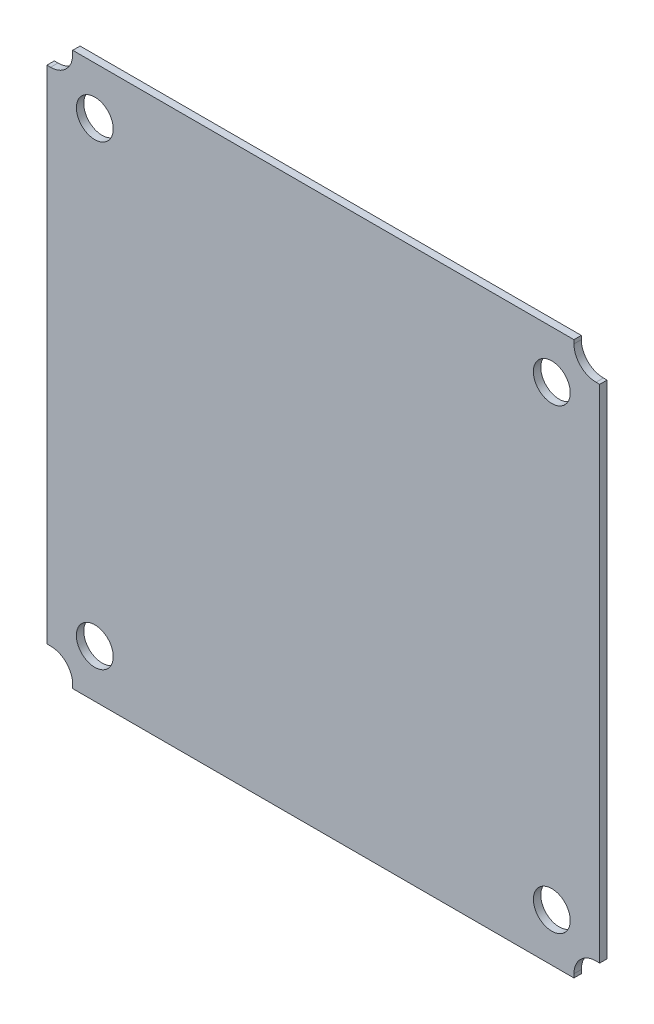
ISO-10303-21;
HEADER;
FILE_DESCRIPTION(('STEP AP214'),'2;1');
FILE_NAME('part.step','',(''),(''),'','','');
FILE_SCHEMA(('AUTOMOTIVE_DESIGN { 1 0 10303 214 1 1 1 1 }'));
ENDSEC;
DATA;
#1=APPLICATION_CONTEXT('core data for automotive mechanical design processes');
#2=APPLICATION_PROTOCOL_DEFINITION('international standard','automotive_design',2000,#1);
#3=PRODUCT_CONTEXT('',#1,'mechanical');
#4=PRODUCT('Part','Part','',(#3));
#5=PRODUCT_RELATED_PRODUCT_CATEGORY('part','',(#4));
#6=PRODUCT_DEFINITION_FORMATION('','',#4);
#7=PRODUCT_DEFINITION_CONTEXT('part definition',#1,'design');
#8=PRODUCT_DEFINITION('design','',#6,#7);
#9=PRODUCT_DEFINITION_SHAPE('','',#8);
#10=(LENGTH_UNIT() NAMED_UNIT(*) SI_UNIT(.MILLI.,.METRE.));
#11=(NAMED_UNIT(*) PLANE_ANGLE_UNIT() SI_UNIT($,.RADIAN.));
#12=(NAMED_UNIT(*) SI_UNIT($,.STERADIAN.) SOLID_ANGLE_UNIT());
#13=UNCERTAINTY_MEASURE_WITH_UNIT(LENGTH_MEASURE(1.E-05),#10,'distance_accuracy_value','');
#14=(GEOMETRIC_REPRESENTATION_CONTEXT(3) GLOBAL_UNCERTAINTY_ASSIGNED_CONTEXT((#13)) GLOBAL_UNIT_ASSIGNED_CONTEXT((#10,
#11,#12)) REPRESENTATION_CONTEXT('',''));
#15=CARTESIAN_POINT('',(0.,0.,0.));
#16=DIRECTION('',(0.,0.,1.));
#17=DIRECTION('',(1.,0.,0.));
#18=AXIS2_PLACEMENT_3D('',#15,#16,#17);
#19=CARTESIAN_POINT('',(0.,0.,1.));
#20=DIRECTION('',(0.,0.,1.));
#21=DIRECTION('',(1.,0.,0.));
#22=AXIS2_PLACEMENT_3D('',#19,#20,#21);
#23=PLANE('',#22);
#24=DIRECTION('',(1.,0.,0.));
#25=VECTOR('',#24,1.);
#26=CARTESIAN_POINT('',(0.,37.5,1.));
#27=LINE('',#26,#25);
#28=CARTESIAN_POINT('',(-34.,37.5,1.));
#29=VERTEX_POINT('',#28);
#30=CARTESIAN_POINT('',(34.,37.5,1.));
#31=VERTEX_POINT('',#30);
#32=EDGE_CURVE('E149',#29,#31,#27,.T.);
#33=ORIENTED_EDGE('',*,*,#32,.F.);
#34=DIRECTION('',(0.,-1.,0.));
#35=VECTOR('',#34,1.);
#36=CARTESIAN_POINT('',(-34.,0.,1.));
#37=LINE('',#36,#35);
#38=CARTESIAN_POINT('',(-34.,37.,1.));
#39=VERTEX_POINT('',#38);
#40=EDGE_CURVE('E228',#29,#39,#37,.T.);
#41=ORIENTED_EDGE('',*,*,#40,.T.);
#42=CARTESIAN_POINT('',(-37.,37.,1.));
#43=DIRECTION('',(0.,0.,1.));
#44=DIRECTION('',(1.,0.,0.));
#45=AXIS2_PLACEMENT_3D('',#42,#43,#44);
#46=CIRCLE('',#45,3.);
#47=CARTESIAN_POINT('',(-37.,34.,1.));
#48=VERTEX_POINT('',#47);
#49=EDGE_CURVE('E11',#39,#48,#46,.F.);
#50=ORIENTED_EDGE('',*,*,#49,.T.);
#51=DIRECTION('',(1.,0.,0.));
#52=VECTOR('',#51,1.);
#53=CARTESIAN_POINT('',(0.,34.,1.));
#54=LINE('',#53,#52);
#55=CARTESIAN_POINT('',(-37.5,34.,1.));
#56=VERTEX_POINT('',#55);
#57=EDGE_CURVE('E283',#56,#48,#54,.T.);
#58=ORIENTED_EDGE('',*,*,#57,.F.);
#59=DIRECTION('',(0.,-1.,0.));
#60=VECTOR('',#59,1.);
#61=CARTESIAN_POINT('',(-37.5,0.,1.));
#62=LINE('',#61,#60);
#63=CARTESIAN_POINT('',(-37.5,-34.,1.));
#64=VERTEX_POINT('',#63);
#65=EDGE_CURVE('E153',#56,#64,#62,.T.);
#66=ORIENTED_EDGE('',*,*,#65,.T.);
#67=DIRECTION('',(1.,0.,0.));
#68=VECTOR('',#67,1.);
#69=CARTESIAN_POINT('',(0.,-34.,1.));
#70=LINE('',#69,#68);
#71=CARTESIAN_POINT('',(-37.,-34.,1.));
#72=VERTEX_POINT('',#71);
#73=EDGE_CURVE('E285',#64,#72,#70,.T.);
#74=ORIENTED_EDGE('',*,*,#73,.T.);
#75=CARTESIAN_POINT('',(-37.,-37.,1.));
#76=DIRECTION('',(0.,0.,1.));
#77=DIRECTION('',(1.,0.,0.));
#78=AXIS2_PLACEMENT_3D('',#75,#76,#77);
#79=CIRCLE('',#78,3.);
#80=CARTESIAN_POINT('',(-34.,-37.,1.));
#81=VERTEX_POINT('',#80);
#82=EDGE_CURVE('E212',#72,#81,#79,.F.);
#83=ORIENTED_EDGE('',*,*,#82,.T.);
#84=DIRECTION('',(0.,-1.,0.));
#85=VECTOR('',#84,1.);
#86=CARTESIAN_POINT('',(-34.,0.,1.));
#87=LINE('',#86,#85);
#88=CARTESIAN_POINT('',(-34.,-37.5,1.));
#89=VERTEX_POINT('',#88);
#90=EDGE_CURVE('E188',#81,#89,#87,.T.);
#91=ORIENTED_EDGE('',*,*,#90,.T.);
#92=DIRECTION('',(1.,0.,0.));
#93=VECTOR('',#92,1.);
#94=CARTESIAN_POINT('',(0.,-37.5,1.));
#95=LINE('',#94,#93);
#96=CARTESIAN_POINT('',(34.,-37.5,1.));
#97=VERTEX_POINT('',#96);
#98=EDGE_CURVE('E244',#89,#97,#95,.T.);
#99=ORIENTED_EDGE('',*,*,#98,.T.);
#100=DIRECTION('',(0.,-1.,0.));
#101=VECTOR('',#100,1.);
#102=CARTESIAN_POINT('',(34.,0.,1.));
#103=LINE('',#102,#101);
#104=CARTESIAN_POINT('',(34.,-37.,1.));
#105=VERTEX_POINT('',#104);
#106=EDGE_CURVE('E271',#105,#97,#103,.T.);
#107=ORIENTED_EDGE('',*,*,#106,.F.);
#108=CARTESIAN_POINT('',(37.,-37.,1.));
#109=DIRECTION('',(0.,0.,1.));
#110=DIRECTION('',(1.,0.,0.));
#111=AXIS2_PLACEMENT_3D('',#108,#109,#110);
#112=CIRCLE('',#111,3.);
#113=CARTESIAN_POINT('',(37.,-34.,1.));
#114=VERTEX_POINT('',#113);
#115=EDGE_CURVE('E207',#105,#114,#112,.F.);
#116=ORIENTED_EDGE('',*,*,#115,.T.);
#117=DIRECTION('',(1.,0.,0.));
#118=VECTOR('',#117,1.);
#119=CARTESIAN_POINT('',(0.,-34.,1.));
#120=LINE('',#119,#118);
#121=CARTESIAN_POINT('',(37.5,-34.,1.));
#122=VERTEX_POINT('',#121);
#123=EDGE_CURVE('E274',#114,#122,#120,.T.);
#124=ORIENTED_EDGE('',*,*,#123,.T.);
#125=DIRECTION('',(0.,-1.,0.));
#126=VECTOR('',#125,1.);
#127=CARTESIAN_POINT('',(37.5,0.,1.));
#128=LINE('',#127,#126);
#129=CARTESIAN_POINT('',(37.5,34.,1.));
#130=VERTEX_POINT('',#129);
#131=EDGE_CURVE('E234',#130,#122,#128,.T.);
#132=ORIENTED_EDGE('',*,*,#131,.F.);
#133=DIRECTION('',(1.,0.,0.));
#134=VECTOR('',#133,1.);
#135=CARTESIAN_POINT('',(0.,34.,1.));
#136=LINE('',#135,#134);
#137=CARTESIAN_POINT('',(37.,34.,1.));
#138=VERTEX_POINT('',#137);
#139=EDGE_CURVE('E277',#138,#130,#136,.T.);
#140=ORIENTED_EDGE('',*,*,#139,.F.);
#141=CARTESIAN_POINT('',(37.,37.,1.));
#142=DIRECTION('',(0.,0.,1.));
#143=DIRECTION('',(1.,0.,0.));
#144=AXIS2_PLACEMENT_3D('',#141,#142,#143);
#145=CIRCLE('',#144,3.);
#146=CARTESIAN_POINT('',(34.,37.,1.));
#147=VERTEX_POINT('',#146);
#148=EDGE_CURVE('E216',#138,#147,#145,.F.);
#149=ORIENTED_EDGE('',*,*,#148,.T.);
#150=DIRECTION('',(0.,-1.,0.));
#151=VECTOR('',#150,1.);
#152=CARTESIAN_POINT('',(34.,0.,1.));
#153=LINE('',#152,#151);
#154=EDGE_CURVE('E280',#31,#147,#153,.T.);
#155=ORIENTED_EDGE('',*,*,#154,.F.);
#156=EDGE_LOOP('',(#33,#41,#50,#58,#66,#74,#83,#91,#99,#107,#116,#124,#132,#140,#149,#155));
#157=FACE_BOUND('',#156,.T.);
#158=CARTESIAN_POINT('',(-31.,-31.,1.));
#159=DIRECTION('',(0.,0.,1.));
#160=DIRECTION('',(1.,0.,0.));
#161=AXIS2_PLACEMENT_3D('',#158,#159,#160);
#162=CIRCLE('',#161,2.5);
#163=CARTESIAN_POINT('',(-28.5,-31.,1.));
#164=VERTEX_POINT('',#163);
#165=EDGE_CURVE('E183',#164,#164,#162,.T.);
#166=ORIENTED_EDGE('',*,*,#165,.F.);
#167=EDGE_LOOP('',(#166));
#168=FACE_BOUND('',#167,.T.);
#169=CARTESIAN_POINT('',(31.,-31.,1.));
#170=DIRECTION('',(0.,0.,1.));
#171=DIRECTION('',(1.,0.,0.));
#172=AXIS2_PLACEMENT_3D('',#169,#170,#171);
#173=CIRCLE('',#172,2.5);
#174=CARTESIAN_POINT('',(33.5,-31.,1.));
#175=VERTEX_POINT('',#174);
#176=EDGE_CURVE('E262',#175,#175,#173,.T.);
#177=ORIENTED_EDGE('',*,*,#176,.F.);
#178=EDGE_LOOP('',(#177));
#179=FACE_BOUND('',#178,.T.);
#180=CARTESIAN_POINT('',(31.,31.,1.));
#181=DIRECTION('',(0.,0.,1.));
#182=DIRECTION('',(1.,0.,0.));
#183=AXIS2_PLACEMENT_3D('',#180,#181,#182);
#184=CIRCLE('',#183,2.5);
#185=CARTESIAN_POINT('',(33.5,31.,1.));
#186=VERTEX_POINT('',#185);
#187=EDGE_CURVE('E265',#186,#186,#184,.T.);
#188=ORIENTED_EDGE('',*,*,#187,.F.);
#189=EDGE_LOOP('',(#188));
#190=FACE_BOUND('',#189,.T.);
#191=CARTESIAN_POINT('',(-31.,31.,1.));
#192=DIRECTION('',(0.,0.,1.));
#193=DIRECTION('',(1.,0.,0.));
#194=AXIS2_PLACEMENT_3D('',#191,#192,#193);
#195=CIRCLE('',#194,2.5);
#196=CARTESIAN_POINT('',(-28.5,31.,1.));
#197=VERTEX_POINT('',#196);
#198=EDGE_CURVE('E268',#197,#197,#195,.T.);
#199=ORIENTED_EDGE('',*,*,#198,.F.);
#200=EDGE_LOOP('',(#199));
#201=FACE_BOUND('',#200,.T.);
#202=ADVANCED_FACE('F35',(#157,#168,#179,#190,#201),#23,.T.);
#203=CARTESIAN_POINT('',(0.,0.,0.));
#204=DIRECTION('',(0.,0.,1.));
#205=DIRECTION('',(1.,0.,0.));
#206=AXIS2_PLACEMENT_3D('',#203,#204,#205);
#207=PLANE('',#206);
#208=CARTESIAN_POINT('',(-31.,-31.,0.));
#209=DIRECTION('',(0.,0.,1.));
#210=DIRECTION('',(1.,0.,0.));
#211=AXIS2_PLACEMENT_3D('',#208,#209,#210);
#212=CIRCLE('',#211,2.5);
#213=CARTESIAN_POINT('',(-28.5,-31.,0.));
#214=VERTEX_POINT('',#213);
#215=EDGE_CURVE('E257',#214,#214,#212,.T.);
#216=ORIENTED_EDGE('',*,*,#215,.T.);
#217=EDGE_LOOP('',(#216));
#218=FACE_BOUND('',#217,.T.);
#219=CARTESIAN_POINT('',(31.,-31.,0.));
#220=DIRECTION('',(0.,0.,1.));
#221=DIRECTION('',(1.,0.,0.));
#222=AXIS2_PLACEMENT_3D('',#219,#220,#221);
#223=CIRCLE('',#222,2.5);
#224=CARTESIAN_POINT('',(33.5,-31.,0.));
#225=VERTEX_POINT('',#224);
#226=EDGE_CURVE('E291',#225,#225,#223,.T.);
#227=ORIENTED_EDGE('',*,*,#226,.T.);
#228=EDGE_LOOP('',(#227));
#229=FACE_BOUND('',#228,.T.);
#230=CARTESIAN_POINT('',(31.,31.,0.));
#231=DIRECTION('',(0.,0.,1.));
#232=DIRECTION('',(1.,0.,0.));
#233=AXIS2_PLACEMENT_3D('',#230,#231,#232);
#234=CIRCLE('',#233,2.5);
#235=CARTESIAN_POINT('',(33.5,31.,0.));
#236=VERTEX_POINT('',#235);
#237=EDGE_CURVE('E294',#236,#236,#234,.T.);
#238=ORIENTED_EDGE('',*,*,#237,.T.);
#239=EDGE_LOOP('',(#238));
#240=FACE_BOUND('',#239,.T.);
#241=CARTESIAN_POINT('',(-31.,31.,0.));
#242=DIRECTION('',(0.,0.,1.));
#243=DIRECTION('',(1.,0.,0.));
#244=AXIS2_PLACEMENT_3D('',#241,#242,#243);
#245=CIRCLE('',#244,2.5);
#246=CARTESIAN_POINT('',(-28.5,31.,0.));
#247=VERTEX_POINT('',#246);
#248=EDGE_CURVE('E297',#247,#247,#245,.T.);
#249=ORIENTED_EDGE('',*,*,#248,.T.);
#250=EDGE_LOOP('',(#249));
#251=FACE_BOUND('',#250,.T.);
#252=DIRECTION('',(0.,-1.,0.));
#253=VECTOR('',#252,1.);
#254=CARTESIAN_POINT('',(-34.,0.,0.));
#255=LINE('',#254,#253);
#256=CARTESIAN_POINT('',(-34.,37.5,0.));
#257=VERTEX_POINT('',#256);
#258=CARTESIAN_POINT('',(-34.,37.,0.));
#259=VERTEX_POINT('',#258);
#260=EDGE_CURVE('E162',#257,#259,#255,.T.);
#261=ORIENTED_EDGE('',*,*,#260,.F.);
#262=DIRECTION('',(1.,0.,0.));
#263=VECTOR('',#262,1.);
#264=CARTESIAN_POINT('',(0.,37.5,0.));
#265=LINE('',#264,#263);
#266=CARTESIAN_POINT('',(34.,37.5,0.));
#267=VERTEX_POINT('',#266);
#268=EDGE_CURVE('E58',#257,#267,#265,.T.);
#269=ORIENTED_EDGE('',*,*,#268,.T.);
#270=DIRECTION('',(0.,-1.,0.));
#271=VECTOR('',#270,1.);
#272=CARTESIAN_POINT('',(34.,0.,0.));
#273=LINE('',#272,#271);
#274=CARTESIAN_POINT('',(34.,37.,0.));
#275=VERTEX_POINT('',#274);
#276=EDGE_CURVE('E159',#267,#275,#273,.T.);
#277=ORIENTED_EDGE('',*,*,#276,.T.);
#278=CARTESIAN_POINT('',(37.,37.,0.));
#279=DIRECTION('',(0.,0.,1.));
#280=DIRECTION('',(1.,0.,0.));
#281=AXIS2_PLACEMENT_3D('',#278,#279,#280);
#282=CIRCLE('',#281,3.);
#283=CARTESIAN_POINT('',(37.,34.,0.));
#284=VERTEX_POINT('',#283);
#285=EDGE_CURVE('E214',#275,#284,#282,.T.);
#286=ORIENTED_EDGE('',*,*,#285,.T.);
#287=DIRECTION('',(1.,0.,0.));
#288=VECTOR('',#287,1.);
#289=CARTESIAN_POINT('',(0.,34.,0.));
#290=LINE('',#289,#288);
#291=CARTESIAN_POINT('',(37.5,34.,0.));
#292=VERTEX_POINT('',#291);
#293=EDGE_CURVE('E168',#284,#292,#290,.T.);
#294=ORIENTED_EDGE('',*,*,#293,.T.);
#295=DIRECTION('',(0.,-1.,0.));
#296=VECTOR('',#295,1.);
#297=CARTESIAN_POINT('',(37.5,0.,0.));
#298=LINE('',#297,#296);
#299=CARTESIAN_POINT('',(37.5,-34.,0.));
#300=VERTEX_POINT('',#299);
#301=EDGE_CURVE('E50',#292,#300,#298,.T.);
#302=ORIENTED_EDGE('',*,*,#301,.T.);
#303=DIRECTION('',(1.,0.,0.));
#304=VECTOR('',#303,1.);
#305=CARTESIAN_POINT('',(0.,-34.,0.));
#306=LINE('',#305,#304);
#307=CARTESIAN_POINT('',(37.,-34.,0.));
#308=VERTEX_POINT('',#307);
#309=EDGE_CURVE('E173',#308,#300,#306,.T.);
#310=ORIENTED_EDGE('',*,*,#309,.F.);
#311=CARTESIAN_POINT('',(37.,-37.,0.));
#312=DIRECTION('',(0.,0.,1.));
#313=DIRECTION('',(1.,0.,0.));
#314=AXIS2_PLACEMENT_3D('',#311,#312,#313);
#315=CIRCLE('',#314,3.);
#316=CARTESIAN_POINT('',(34.,-37.,0.));
#317=VERTEX_POINT('',#316);
#318=EDGE_CURVE('E205',#308,#317,#315,.T.);
#319=ORIENTED_EDGE('',*,*,#318,.T.);
#320=DIRECTION('',(0.,-1.,0.));
#321=VECTOR('',#320,1.);
#322=CARTESIAN_POINT('',(34.,0.,0.));
#323=LINE('',#322,#321);
#324=CARTESIAN_POINT('',(34.,-37.5,0.));
#325=VERTEX_POINT('',#324);
#326=EDGE_CURVE('E300',#317,#325,#323,.T.);
#327=ORIENTED_EDGE('',*,*,#326,.T.);
#328=DIRECTION('',(1.,0.,0.));
#329=VECTOR('',#328,1.);
#330=CARTESIAN_POINT('',(0.,-37.5,0.));
#331=LINE('',#330,#329);
#332=CARTESIAN_POINT('',(-34.,-37.5,0.));
#333=VERTEX_POINT('',#332);
#334=EDGE_CURVE('E241',#333,#325,#331,.T.);
#335=ORIENTED_EDGE('',*,*,#334,.F.);
#336=DIRECTION('',(0.,-1.,0.));
#337=VECTOR('',#336,1.);
#338=CARTESIAN_POINT('',(-34.,0.,0.));
#339=LINE('',#338,#337);
#340=CARTESIAN_POINT('',(-34.,-37.,0.));
#341=VERTEX_POINT('',#340);
#342=EDGE_CURVE('E180',#341,#333,#339,.T.);
#343=ORIENTED_EDGE('',*,*,#342,.F.);
#344=CARTESIAN_POINT('',(-37.,-37.,0.));
#345=DIRECTION('',(0.,0.,1.));
#346=DIRECTION('',(1.,0.,0.));
#347=AXIS2_PLACEMENT_3D('',#344,#345,#346);
#348=CIRCLE('',#347,3.);
#349=CARTESIAN_POINT('',(-37.,-34.,0.));
#350=VERTEX_POINT('',#349);
#351=EDGE_CURVE('E209',#341,#350,#348,.T.);
#352=ORIENTED_EDGE('',*,*,#351,.T.);
#353=DIRECTION('',(1.,0.,0.));
#354=VECTOR('',#353,1.);
#355=CARTESIAN_POINT('',(0.,-34.,0.));
#356=LINE('',#355,#354);
#357=CARTESIAN_POINT('',(-37.5,-34.,0.));
#358=VERTEX_POINT('',#357);
#359=EDGE_CURVE('E178',#358,#350,#356,.T.);
#360=ORIENTED_EDGE('',*,*,#359,.F.);
#361=DIRECTION('',(0.,-1.,0.));
#362=VECTOR('',#361,1.);
#363=CARTESIAN_POINT('',(-37.5,0.,0.));
#364=LINE('',#363,#362);
#365=CARTESIAN_POINT('',(-37.5,34.,0.));
#366=VERTEX_POINT('',#365);
#367=EDGE_CURVE('E250',#366,#358,#364,.T.);
#368=ORIENTED_EDGE('',*,*,#367,.F.);
#369=DIRECTION('',(1.,0.,0.));
#370=VECTOR('',#369,1.);
#371=CARTESIAN_POINT('',(0.,34.,0.));
#372=LINE('',#371,#370);
#373=CARTESIAN_POINT('',(-37.,34.,0.));
#374=VERTEX_POINT('',#373);
#375=EDGE_CURVE('E170',#366,#374,#372,.T.);
#376=ORIENTED_EDGE('',*,*,#375,.T.);
#377=CARTESIAN_POINT('',(-37.,37.,0.));
#378=DIRECTION('',(0.,0.,1.));
#379=DIRECTION('',(1.,0.,0.));
#380=AXIS2_PLACEMENT_3D('',#377,#378,#379);
#381=CIRCLE('',#380,3.);
#382=EDGE_CURVE('E43',#374,#259,#381,.T.);
#383=ORIENTED_EDGE('',*,*,#382,.T.);
#384=EDGE_LOOP('',(#261,#269,#277,#286,#294,#302,#310,#319,#327,#335,#343,#352,#360,#368,#376,#383));
#385=FACE_BOUND('',#384,.T.);
#386=ADVANCED_FACE('F158',(#218,#229,#240,#251,#385),#207,.F.);
#387=CARTESIAN_POINT('',(34.,0.,1.));
#388=DIRECTION('',(1.,0.,0.));
#389=DIRECTION('',(0.,1.,0.));
#390=AXIS2_PLACEMENT_3D('',#387,#388,#389);
#391=PLANE('',#390);
#392=ORIENTED_EDGE('',*,*,#106,.T.);
#393=DIRECTION('',(0.,0.,1.));
#394=VECTOR('',#393,1.);
#395=CARTESIAN_POINT('',(34.,-37.5,0.));
#396=LINE('',#395,#394);
#397=EDGE_CURVE('E236',#325,#97,#396,.T.);
#398=ORIENTED_EDGE('',*,*,#397,.F.);
#399=ORIENTED_EDGE('',*,*,#326,.F.);
#400=DIRECTION('',(0.,0.,-1.));
#401=VECTOR('',#400,1.);
#402=CARTESIAN_POINT('',(34.,-37.,1.));
#403=LINE('',#402,#401);
#404=EDGE_CURVE('E187',#317,#105,#403,.F.);
#405=ORIENTED_EDGE('',*,*,#404,.T.);
#406=EDGE_LOOP('',(#392,#398,#399,#405));
#407=FACE_BOUND('',#406,.T.);
#408=ADVANCED_FACE('F334',(#407),#391,.T.);
#409=CARTESIAN_POINT('',(-34.,0.,1.));
#410=DIRECTION('',(1.,0.,0.));
#411=DIRECTION('',(0.,1.,0.));
#412=AXIS2_PLACEMENT_3D('',#409,#410,#411);
#413=PLANE('',#412);
#414=DIRECTION('',(0.,0.,1.));
#415=VECTOR('',#414,1.);
#416=CARTESIAN_POINT('',(-34.,-37.5,0.));
#417=LINE('',#416,#415);
#418=EDGE_CURVE('E243',#333,#89,#417,.T.);
#419=ORIENTED_EDGE('',*,*,#418,.T.);
#420=ORIENTED_EDGE('',*,*,#90,.F.);
#421=DIRECTION('',(0.,0.,-1.));
#422=VECTOR('',#421,1.);
#423=CARTESIAN_POINT('',(-34.,-37.,0.));
#424=LINE('',#423,#422);
#425=EDGE_CURVE('E190',#81,#341,#424,.T.);
#426=ORIENTED_EDGE('',*,*,#425,.T.);
#427=ORIENTED_EDGE('',*,*,#342,.T.);
#428=EDGE_LOOP('',(#419,#420,#426,#427));
#429=FACE_BOUND('',#428,.T.);
#430=ADVANCED_FACE('F340',(#429),#413,.F.);
#431=CARTESIAN_POINT('',(0.,34.,1.));
#432=DIRECTION('',(0.,1.,0.));
#433=DIRECTION('',(0.,0.,1.));
#434=AXIS2_PLACEMENT_3D('',#431,#432,#433);
#435=PLANE('',#434);
#436=ORIENTED_EDGE('',*,*,#375,.F.);
#437=DIRECTION('',(0.,0.,1.));
#438=VECTOR('',#437,1.);
#439=CARTESIAN_POINT('',(-37.5,34.,0.));
#440=LINE('',#439,#438);
#441=EDGE_CURVE('E252',#366,#56,#440,.T.);
#442=ORIENTED_EDGE('',*,*,#441,.T.);
#443=ORIENTED_EDGE('',*,*,#57,.T.);
#444=DIRECTION('',(0.,0.,-1.));
#445=VECTOR('',#444,1.);
#446=CARTESIAN_POINT('',(-37.,34.,1.));
#447=LINE('',#446,#445);
#448=EDGE_CURVE('E199',#48,#374,#447,.T.);
#449=ORIENTED_EDGE('',*,*,#448,.T.);
#450=EDGE_LOOP('',(#436,#442,#443,#449));
#451=FACE_BOUND('',#450,.T.);
#452=ADVANCED_FACE('F343',(#451),#435,.T.);
#453=CARTESIAN_POINT('',(0.,-34.,1.));
#454=DIRECTION('',(0.,1.,0.));
#455=DIRECTION('',(-1.,0.,0.));
#456=AXIS2_PLACEMENT_3D('',#453,#454,#455);
#457=PLANE('',#456);
#458=DIRECTION('',(0.,0.,1.));
#459=VECTOR('',#458,1.);
#460=CARTESIAN_POINT('',(-37.5,-34.,0.));
#461=LINE('',#460,#459);
#462=EDGE_CURVE('E255',#358,#64,#461,.T.);
#463=ORIENTED_EDGE('',*,*,#462,.F.);
#464=ORIENTED_EDGE('',*,*,#359,.T.);
#465=DIRECTION('',(0.,0.,-1.));
#466=VECTOR('',#465,1.);
#467=CARTESIAN_POINT('',(-37.,-34.,1.));
#468=LINE('',#467,#466);
#469=EDGE_CURVE('E193',#350,#72,#468,.F.);
#470=ORIENTED_EDGE('',*,*,#469,.T.);
#471=ORIENTED_EDGE('',*,*,#73,.F.);
#472=EDGE_LOOP('',(#463,#464,#470,#471));
#473=FACE_BOUND('',#472,.T.);
#474=ADVANCED_FACE('F345',(#473),#457,.F.);
#475=CARTESIAN_POINT('',(0.,-34.,1.));
#476=DIRECTION('',(0.,1.,0.));
#477=DIRECTION('',(-1.,0.,0.));
#478=AXIS2_PLACEMENT_3D('',#475,#476,#477);
#479=PLANE('',#478);
#480=ORIENTED_EDGE('',*,*,#309,.T.);
#481=DIRECTION('',(0.,0.,1.));
#482=VECTOR('',#481,1.);
#483=CARTESIAN_POINT('',(37.5,-34.,0.));
#484=LINE('',#483,#482);
#485=EDGE_CURVE('E237',#300,#122,#484,.T.);
#486=ORIENTED_EDGE('',*,*,#485,.T.);
#487=ORIENTED_EDGE('',*,*,#123,.F.);
#488=DIRECTION('',(0.,0.,-1.));
#489=VECTOR('',#488,1.);
#490=CARTESIAN_POINT('',(37.,-34.,1.));
#491=LINE('',#490,#489);
#492=EDGE_CURVE('E184',#114,#308,#491,.T.);
#493=ORIENTED_EDGE('',*,*,#492,.T.);
#494=EDGE_LOOP('',(#480,#486,#487,#493));
#495=FACE_BOUND('',#494,.T.);
#496=ADVANCED_FACE('F305',(#495),#479,.F.);
#497=CARTESIAN_POINT('',(0.,34.,1.));
#498=DIRECTION('',(0.,1.,0.));
#499=DIRECTION('',(0.,0.,1.));
#500=AXIS2_PLACEMENT_3D('',#497,#498,#499);
#501=PLANE('',#500);
#502=DIRECTION('',(0.,0.,1.));
#503=VECTOR('',#502,1.);
#504=CARTESIAN_POINT('',(37.5,34.,0.));
#505=LINE('',#504,#503);
#506=EDGE_CURVE('E233',#292,#130,#505,.T.);
#507=ORIENTED_EDGE('',*,*,#506,.F.);
#508=ORIENTED_EDGE('',*,*,#293,.F.);
#509=DIRECTION('',(0.,0.,-1.));
#510=VECTOR('',#509,1.);
#511=CARTESIAN_POINT('',(37.,34.,1.));
#512=LINE('',#511,#510);
#513=EDGE_CURVE('E197',#284,#138,#512,.F.);
#514=ORIENTED_EDGE('',*,*,#513,.T.);
#515=ORIENTED_EDGE('',*,*,#139,.T.);
#516=EDGE_LOOP('',(#507,#508,#514,#515));
#517=FACE_BOUND('',#516,.T.);
#518=ADVANCED_FACE('F312',(#517),#501,.T.);
#519=CARTESIAN_POINT('',(34.,0.,1.));
#520=DIRECTION('',(1.,0.,0.));
#521=DIRECTION('',(0.,1.,0.));
#522=AXIS2_PLACEMENT_3D('',#519,#520,#521);
#523=PLANE('',#522);
#524=DIRECTION('',(0.,0.,1.));
#525=VECTOR('',#524,1.);
#526=CARTESIAN_POINT('',(34.,37.5,0.));
#527=LINE('',#526,#525);
#528=EDGE_CURVE('E146',#267,#31,#527,.T.);
#529=ORIENTED_EDGE('',*,*,#528,.T.);
#530=ORIENTED_EDGE('',*,*,#154,.T.);
#531=DIRECTION('',(0.,0.,-1.));
#532=VECTOR('',#531,1.);
#533=CARTESIAN_POINT('',(34.,37.,0.));
#534=LINE('',#533,#532);
#535=EDGE_CURVE('E167',#147,#275,#534,.T.);
#536=ORIENTED_EDGE('',*,*,#535,.T.);
#537=ORIENTED_EDGE('',*,*,#276,.F.);
#538=EDGE_LOOP('',(#529,#530,#536,#537));
#539=FACE_BOUND('',#538,.T.);
#540=ADVANCED_FACE('F165',(#539),#523,.T.);
#541=CARTESIAN_POINT('',(-34.,0.,1.));
#542=DIRECTION('',(1.,0.,0.));
#543=DIRECTION('',(0.,1.,0.));
#544=AXIS2_PLACEMENT_3D('',#541,#542,#543);
#545=PLANE('',#544);
#546=ORIENTED_EDGE('',*,*,#40,.F.);
#547=DIRECTION('',(0.,0.,1.));
#548=VECTOR('',#547,1.);
#549=CARTESIAN_POINT('',(-34.,37.5,0.));
#550=LINE('',#549,#548);
#551=EDGE_CURVE('E154',#257,#29,#550,.T.);
#552=ORIENTED_EDGE('',*,*,#551,.F.);
#553=ORIENTED_EDGE('',*,*,#260,.T.);
#554=DIRECTION('',(0.,0.,-1.));
#555=VECTOR('',#554,1.);
#556=CARTESIAN_POINT('',(-34.,37.,1.));
#557=LINE('',#556,#555);
#558=EDGE_CURVE('E202',#259,#39,#557,.F.);
#559=ORIENTED_EDGE('',*,*,#558,.T.);
#560=EDGE_LOOP('',(#546,#552,#553,#559));
#561=FACE_BOUND('',#560,.T.);
#562=ADVANCED_FACE('F227',(#561),#545,.F.);
#563=CARTESIAN_POINT('',(-31.,31.,1.));
#564=DIRECTION('',(0.,0.,-1.));
#565=DIRECTION('',(-1.,0.,0.));
#566=AXIS2_PLACEMENT_3D('',#563,#564,#565);
#567=CYLINDRICAL_SURFACE('',#566,2.5);
#568=ORIENTED_EDGE('',*,*,#198,.T.);
#569=EDGE_LOOP('',(#568));
#570=FACE_BOUND('',#569,.T.);
#571=ORIENTED_EDGE('',*,*,#248,.F.);
#572=EDGE_LOOP('',(#571));
#573=FACE_BOUND('',#572,.T.);
#574=ADVANCED_FACE('F354',(#570,#573),#567,.F.);
#575=CARTESIAN_POINT('',(31.,31.,1.));
#576=DIRECTION('',(0.,0.,-1.));
#577=DIRECTION('',(-1.,0.,0.));
#578=AXIS2_PLACEMENT_3D('',#575,#576,#577);
#579=CYLINDRICAL_SURFACE('',#578,2.5);
#580=ORIENTED_EDGE('',*,*,#187,.T.);
#581=EDGE_LOOP('',(#580));
#582=FACE_BOUND('',#581,.T.);
#583=ORIENTED_EDGE('',*,*,#237,.F.);
#584=EDGE_LOOP('',(#583));
#585=FACE_BOUND('',#584,.T.);
#586=ADVANCED_FACE('F366',(#582,#585),#579,.F.);
#587=CARTESIAN_POINT('',(31.,-31.,1.));
#588=DIRECTION('',(0.,0.,-1.));
#589=DIRECTION('',(-1.,0.,0.));
#590=AXIS2_PLACEMENT_3D('',#587,#588,#589);
#591=CYLINDRICAL_SURFACE('',#590,2.5);
#592=ORIENTED_EDGE('',*,*,#176,.T.);
#593=EDGE_LOOP('',(#592));
#594=FACE_BOUND('',#593,.T.);
#595=ORIENTED_EDGE('',*,*,#226,.F.);
#596=EDGE_LOOP('',(#595));
#597=FACE_BOUND('',#596,.T.);
#598=ADVANCED_FACE('F370',(#594,#597),#591,.F.);
#599=CARTESIAN_POINT('',(-31.,-31.,1.));
#600=DIRECTION('',(0.,0.,-1.));
#601=DIRECTION('',(-1.,0.,0.));
#602=AXIS2_PLACEMENT_3D('',#599,#600,#601);
#603=CYLINDRICAL_SURFACE('',#602,2.5);
#604=ORIENTED_EDGE('',*,*,#165,.T.);
#605=EDGE_LOOP('',(#604));
#606=FACE_BOUND('',#605,.T.);
#607=ORIENTED_EDGE('',*,*,#215,.F.);
#608=EDGE_LOOP('',(#607));
#609=FACE_BOUND('',#608,.T.);
#610=ADVANCED_FACE('F374',(#606,#609),#603,.F.);
#611=CARTESIAN_POINT('',(37.,-37.,1.));
#612=DIRECTION('',(0.,0.,-1.));
#613=DIRECTION('',(-1.,0.,0.));
#614=AXIS2_PLACEMENT_3D('',#611,#612,#613);
#615=CYLINDRICAL_SURFACE('',#614,3.);
#616=ORIENTED_EDGE('',*,*,#115,.F.);
#617=ORIENTED_EDGE('',*,*,#404,.F.);
#618=ORIENTED_EDGE('',*,*,#318,.F.);
#619=ORIENTED_EDGE('',*,*,#492,.F.);
#620=EDGE_LOOP('',(#616,#617,#618,#619));
#621=FACE_BOUND('',#620,.T.);
#622=ADVANCED_FACE('F378',(#621),#615,.F.);
#623=CARTESIAN_POINT('',(-37.,-37.,1.));
#624=DIRECTION('',(0.,0.,1.));
#625=DIRECTION('',(1.,0.,0.));
#626=AXIS2_PLACEMENT_3D('',#623,#624,#625);
#627=CYLINDRICAL_SURFACE('',#626,3.);
#628=ORIENTED_EDGE('',*,*,#82,.F.);
#629=ORIENTED_EDGE('',*,*,#469,.F.);
#630=ORIENTED_EDGE('',*,*,#351,.F.);
#631=ORIENTED_EDGE('',*,*,#425,.F.);
#632=EDGE_LOOP('',(#628,#629,#630,#631));
#633=FACE_BOUND('',#632,.T.);
#634=ADVANCED_FACE('F382',(#633),#627,.F.);
#635=CARTESIAN_POINT('',(37.,37.,1.));
#636=DIRECTION('',(0.,0.,1.));
#637=DIRECTION('',(1.,0.,0.));
#638=AXIS2_PLACEMENT_3D('',#635,#636,#637);
#639=CYLINDRICAL_SURFACE('',#638,3.);
#640=ORIENTED_EDGE('',*,*,#148,.F.);
#641=ORIENTED_EDGE('',*,*,#513,.F.);
#642=ORIENTED_EDGE('',*,*,#285,.F.);
#643=ORIENTED_EDGE('',*,*,#535,.F.);
#644=EDGE_LOOP('',(#640,#641,#642,#643));
#645=FACE_BOUND('',#644,.T.);
#646=ADVANCED_FACE('F316',(#645),#639,.F.);
#647=CARTESIAN_POINT('',(-37.,37.,1.));
#648=DIRECTION('',(0.,0.,-1.));
#649=DIRECTION('',(-1.,0.,0.));
#650=AXIS2_PLACEMENT_3D('',#647,#648,#649);
#651=CYLINDRICAL_SURFACE('',#650,3.);
#652=ORIENTED_EDGE('',*,*,#49,.F.);
#653=ORIENTED_EDGE('',*,*,#558,.F.);
#654=ORIENTED_EDGE('',*,*,#382,.F.);
#655=ORIENTED_EDGE('',*,*,#448,.F.);
#656=EDGE_LOOP('',(#652,#653,#654,#655));
#657=FACE_BOUND('',#656,.T.);
#658=ADVANCED_FACE('F37',(#657),#651,.F.);
#659=CARTESIAN_POINT('',(-37.5,0.,0.));
#660=DIRECTION('',(-1.,0.,0.));
#661=DIRECTION('',(0.,-1.,0.));
#662=AXIS2_PLACEMENT_3D('',#659,#660,#661);
#663=PLANE('',#662);
#664=ORIENTED_EDGE('',*,*,#65,.F.);
#665=ORIENTED_EDGE('',*,*,#441,.F.);
#666=ORIENTED_EDGE('',*,*,#367,.T.);
#667=ORIENTED_EDGE('',*,*,#462,.T.);
#668=EDGE_LOOP('',(#664,#665,#666,#667));
#669=FACE_BOUND('',#668,.T.);
#670=ADVANCED_FACE('F338',(#669),#663,.T.);
#671=CARTESIAN_POINT('',(0.,-37.5,0.));
#672=DIRECTION('',(0.,-1.,0.));
#673=DIRECTION('',(0.,0.,-1.));
#674=AXIS2_PLACEMENT_3D('',#671,#672,#673);
#675=PLANE('',#674);
#676=ORIENTED_EDGE('',*,*,#98,.F.);
#677=ORIENTED_EDGE('',*,*,#418,.F.);
#678=ORIENTED_EDGE('',*,*,#334,.T.);
#679=ORIENTED_EDGE('',*,*,#397,.T.);
#680=EDGE_LOOP('',(#676,#677,#678,#679));
#681=FACE_BOUND('',#680,.T.);
#682=ADVANCED_FACE('F326',(#681),#675,.T.);
#683=CARTESIAN_POINT('',(0.,37.5,0.));
#684=DIRECTION('',(0.,-1.,0.));
#685=DIRECTION('',(0.,0.,-1.));
#686=AXIS2_PLACEMENT_3D('',#683,#684,#685);
#687=PLANE('',#686);
#688=ORIENTED_EDGE('',*,*,#32,.T.);
#689=ORIENTED_EDGE('',*,*,#528,.F.);
#690=ORIENTED_EDGE('',*,*,#268,.F.);
#691=ORIENTED_EDGE('',*,*,#551,.T.);
#692=EDGE_LOOP('',(#688,#689,#690,#691));
#693=FACE_BOUND('',#692,.T.);
#694=ADVANCED_FACE('F147',(#693),#687,.F.);
#695=CARTESIAN_POINT('',(37.5,0.,0.));
#696=DIRECTION('',(-1.,0.,0.));
#697=DIRECTION('',(0.,-1.,0.));
#698=AXIS2_PLACEMENT_3D('',#695,#696,#697);
#699=PLANE('',#698);
#700=ORIENTED_EDGE('',*,*,#131,.T.);
#701=ORIENTED_EDGE('',*,*,#485,.F.);
#702=ORIENTED_EDGE('',*,*,#301,.F.);
#703=ORIENTED_EDGE('',*,*,#506,.T.);
#704=EDGE_LOOP('',(#700,#701,#702,#703));
#705=FACE_BOUND('',#704,.T.);
#706=ADVANCED_FACE('F320',(#705),#699,.F.);
#707=CLOSED_SHELL('',(#202,#386,#408,#430,#452,#474,#496,#518,#540,#562,#574,#586,#598,#610,
#622,#634,#646,#658,#670,#682,#694,#706));
#708=MANIFOLD_SOLID_BREP('B2',#707);
#709=ADVANCED_BREP_SHAPE_REPRESENTATION('',(#18,#708),#14);
#710=SHAPE_DEFINITION_REPRESENTATION(#9,#709);
ENDSEC;
END-ISO-10303-21;
